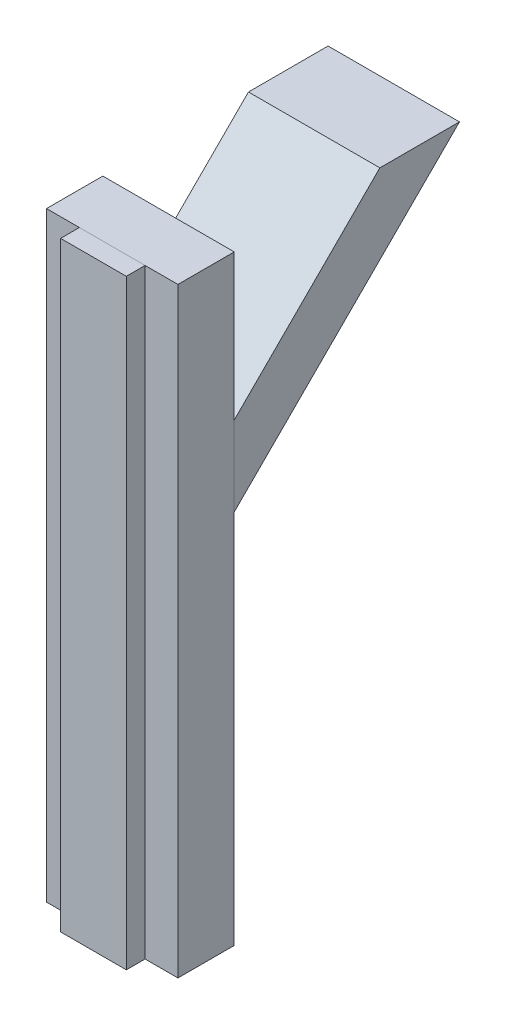
ISO-10303-21;
HEADER;
FILE_DESCRIPTION(('STEP AP214'),'2;1');
FILE_NAME('part.step','',(''),(''),'','','');
FILE_SCHEMA(('AUTOMOTIVE_DESIGN { 1 0 10303 214 1 1 1 1 }'));
ENDSEC;
DATA;
#1=APPLICATION_CONTEXT('core data for automotive mechanical design processes');
#2=APPLICATION_PROTOCOL_DEFINITION('international standard','automotive_design',2000,#1);
#3=PRODUCT_CONTEXT('',#1,'mechanical');
#4=PRODUCT('Part','Part','',(#3));
#5=PRODUCT_RELATED_PRODUCT_CATEGORY('part','',(#4));
#6=PRODUCT_DEFINITION_FORMATION('','',#4);
#7=PRODUCT_DEFINITION_CONTEXT('part definition',#1,'design');
#8=PRODUCT_DEFINITION('design','',#6,#7);
#9=PRODUCT_DEFINITION_SHAPE('','',#8);
#10=(LENGTH_UNIT() NAMED_UNIT(*) SI_UNIT(.MILLI.,.METRE.));
#11=(NAMED_UNIT(*) PLANE_ANGLE_UNIT() SI_UNIT($,.RADIAN.));
#12=(NAMED_UNIT(*) SI_UNIT($,.STERADIAN.) SOLID_ANGLE_UNIT());
#13=UNCERTAINTY_MEASURE_WITH_UNIT(LENGTH_MEASURE(1.E-05),#10,'distance_accuracy_value','');
#14=(GEOMETRIC_REPRESENTATION_CONTEXT(3) GLOBAL_UNCERTAINTY_ASSIGNED_CONTEXT((#13)) GLOBAL_UNIT_ASSIGNED_CONTEXT((#10,
#11,#12)) REPRESENTATION_CONTEXT('',''));
#15=CARTESIAN_POINT('',(0.,0.,0.));
#16=DIRECTION('',(0.,0.,1.));
#17=DIRECTION('',(1.,0.,0.));
#18=AXIS2_PLACEMENT_3D('',#15,#16,#17);
#19=CARTESIAN_POINT('',(66.675,0.,31.7499999999999));
#20=DIRECTION('',(-1.,0.,0.));
#21=DIRECTION('',(0.,0.,1.));
#22=AXIS2_PLACEMENT_3D('',#19,#20,#21);
#23=PLANE('',#22);
#24=DIRECTION('',(0.,1.,0.));
#25=VECTOR('',#24,1.);
#26=CARTESIAN_POINT('',(66.675,0.,19.0499999999999));
#27=LINE('',#26,#25);
#28=CARTESIAN_POINT('',(66.675,-406.4,19.0499999999999));
#29=VERTEX_POINT('',#28);
#30=CARTESIAN_POINT('',(66.675,0.,19.0499999999999));
#31=VERTEX_POINT('',#30);
#32=EDGE_CURVE('E107',#29,#31,#27,.T.);
#33=ORIENTED_EDGE('',*,*,#32,.T.);
#34=DIRECTION('',(0.,0.,-1.));
#35=VECTOR('',#34,1.);
#36=CARTESIAN_POINT('',(66.675,0.,31.7499999999999));
#37=LINE('',#36,#35);
#38=CARTESIAN_POINT('',(66.675,0.,31.7499999999999));
#39=VERTEX_POINT('',#38);
#40=EDGE_CURVE('E12',#39,#31,#37,.T.);
#41=ORIENTED_EDGE('',*,*,#40,.F.);
#42=DIRECTION('',(0.,1.,0.));
#43=VECTOR('',#42,1.);
#44=CARTESIAN_POINT('',(66.675,0.,31.7499999999999));
#45=LINE('',#44,#43);
#46=CARTESIAN_POINT('',(66.675,-406.4,31.7499999999999));
#47=VERTEX_POINT('',#46);
#48=EDGE_CURVE('E95',#47,#39,#45,.T.);
#49=ORIENTED_EDGE('',*,*,#48,.F.);
#50=DIRECTION('',(0.,0.,-1.));
#51=VECTOR('',#50,1.);
#52=CARTESIAN_POINT('',(66.675,-406.4,31.7499999999999));
#53=LINE('',#52,#51);
#54=EDGE_CURVE('E103',#47,#29,#53,.T.);
#55=ORIENTED_EDGE('',*,*,#54,.T.);
#56=EDGE_LOOP('',(#33,#41,#49,#55));
#57=FACE_BOUND('',#56,.T.);
#58=ADVANCED_FACE('F44',(#57),#23,.F.);
#59=CARTESIAN_POINT('',(66.675,0.,31.7499999999999));
#60=DIRECTION('',(0.,-1.,0.));
#61=DIRECTION('',(1.,0.,0.));
#62=AXIS2_PLACEMENT_3D('',#59,#60,#61);
#63=PLANE('',#62);
#64=DIRECTION('',(-1.,0.,0.));
#65=VECTOR('',#64,1.);
#66=CARTESIAN_POINT('',(66.675,0.,19.0499999999999));
#67=LINE('',#66,#65);
#68=CARTESIAN_POINT('',(22.225,0.,19.0499999999999));
#69=VERTEX_POINT('',#68);
#70=EDGE_CURVE('E99',#31,#69,#67,.T.);
#71=ORIENTED_EDGE('',*,*,#70,.T.);
#72=DIRECTION('',(0.,0.,-1.));
#73=VECTOR('',#72,1.);
#74=CARTESIAN_POINT('',(22.225,0.,31.7499999999999));
#75=LINE('',#74,#73);
#76=CARTESIAN_POINT('',(22.225,0.,31.7499999999999));
#77=VERTEX_POINT('',#76);
#78=EDGE_CURVE('E52',#77,#69,#75,.T.);
#79=ORIENTED_EDGE('',*,*,#78,.F.);
#80=DIRECTION('',(-1.,0.,0.));
#81=VECTOR('',#80,1.);
#82=CARTESIAN_POINT('',(66.675,0.,31.7499999999999));
#83=LINE('',#82,#81);
#84=EDGE_CURVE('E90',#39,#77,#83,.T.);
#85=ORIENTED_EDGE('',*,*,#84,.F.);
#86=ORIENTED_EDGE('',*,*,#40,.T.);
#87=EDGE_LOOP('',(#71,#79,#85,#86));
#88=FACE_BOUND('',#87,.T.);
#89=ADVANCED_FACE('F98',(#88),#63,.F.);
#90=CARTESIAN_POINT('',(22.225,0.,31.7499999999999));
#91=DIRECTION('',(1.,0.,0.));
#92=DIRECTION('',(0.,1.,0.));
#93=AXIS2_PLACEMENT_3D('',#90,#91,#92);
#94=PLANE('',#93);
#95=DIRECTION('',(0.,-1.,0.));
#96=VECTOR('',#95,1.);
#97=CARTESIAN_POINT('',(22.225,0.,19.0499999999999));
#98=LINE('',#97,#96);
#99=CARTESIAN_POINT('',(22.225,-406.4,19.0499999999999));
#100=VERTEX_POINT('',#99);
#101=EDGE_CURVE('E77',#69,#100,#98,.T.);
#102=ORIENTED_EDGE('',*,*,#101,.T.);
#103=DIRECTION('',(0.,0.,-1.));
#104=VECTOR('',#103,1.);
#105=CARTESIAN_POINT('',(22.225,-406.4,31.7499999999999));
#106=LINE('',#105,#104);
#107=CARTESIAN_POINT('',(22.225,-406.4,31.7499999999999));
#108=VERTEX_POINT('',#107);
#109=EDGE_CURVE('E100',#108,#100,#106,.T.);
#110=ORIENTED_EDGE('',*,*,#109,.F.);
#111=DIRECTION('',(0.,-1.,0.));
#112=VECTOR('',#111,1.);
#113=CARTESIAN_POINT('',(22.225,0.,31.7499999999999));
#114=LINE('',#113,#112);
#115=EDGE_CURVE('E93',#77,#108,#114,.T.);
#116=ORIENTED_EDGE('',*,*,#115,.F.);
#117=ORIENTED_EDGE('',*,*,#78,.T.);
#118=EDGE_LOOP('',(#102,#110,#116,#117));
#119=FACE_BOUND('',#118,.T.);
#120=ADVANCED_FACE('F101',(#119),#94,.F.);
#121=CARTESIAN_POINT('',(66.675,-406.4,31.7499999999999));
#122=DIRECTION('',(0.,1.,0.));
#123=DIRECTION('',(0.,0.,1.));
#124=AXIS2_PLACEMENT_3D('',#121,#122,#123);
#125=PLANE('',#124);
#126=DIRECTION('',(1.,0.,0.));
#127=VECTOR('',#126,1.);
#128=CARTESIAN_POINT('',(66.675,-406.4,19.0499999999999));
#129=LINE('',#128,#127);
#130=EDGE_CURVE('E83',#100,#29,#129,.T.);
#131=ORIENTED_EDGE('',*,*,#130,.T.);
#132=ORIENTED_EDGE('',*,*,#54,.F.);
#133=DIRECTION('',(1.,0.,0.));
#134=VECTOR('',#133,1.);
#135=CARTESIAN_POINT('',(66.675,-406.4,31.7499999999999));
#136=LINE('',#135,#134);
#137=EDGE_CURVE('E60',#108,#47,#136,.T.);
#138=ORIENTED_EDGE('',*,*,#137,.F.);
#139=ORIENTED_EDGE('',*,*,#109,.T.);
#140=EDGE_LOOP('',(#131,#132,#138,#139));
#141=FACE_BOUND('',#140,.T.);
#142=ADVANCED_FACE('F114',(#141),#125,.F.);
#143=CARTESIAN_POINT('',(0.,0.,31.7499999999999));
#144=DIRECTION('',(0.,0.,-1.));
#145=DIRECTION('',(-1.,0.,0.));
#146=AXIS2_PLACEMENT_3D('',#143,#144,#145);
#147=PLANE('',#146);
#148=ORIENTED_EDGE('',*,*,#48,.T.);
#149=ORIENTED_EDGE('',*,*,#84,.T.);
#150=ORIENTED_EDGE('',*,*,#115,.T.);
#151=ORIENTED_EDGE('',*,*,#137,.T.);
#152=EDGE_LOOP('',(#148,#149,#150,#151));
#153=FACE_BOUND('',#152,.T.);
#154=ADVANCED_FACE('F91',(#153),#147,.F.);
#155=CARTESIAN_POINT('',(0.,0.,19.0499999999999));
#156=DIRECTION('',(0.,0.,-1.));
#157=DIRECTION('',(-1.,0.,0.));
#158=AXIS2_PLACEMENT_3D('',#155,#156,#157);
#159=PLANE('',#158);
#160=ORIENTED_EDGE('',*,*,#32,.F.);
#161=ORIENTED_EDGE('',*,*,#130,.F.);
#162=ORIENTED_EDGE('',*,*,#101,.F.);
#163=ORIENTED_EDGE('',*,*,#70,.F.);
#164=EDGE_LOOP('',(#160,#161,#162,#163));
#165=FACE_BOUND('',#164,.T.);
#166=ADVANCED_FACE('F117',(#165),#159,.T.);
#167=CLOSED_SHELL('',(#58,#89,#120,#142,#154,#166));
#168=MANIFOLD_SOLID_BREP('B2',#167);
#169=CARTESIAN_POINT('',(88.9,-98.5184632735851,-19.05));
#170=DIRECTION('',(0.,0.,-1.));
#171=DIRECTION('',(0.,1.,0.));
#172=AXIS2_PLACEMENT_3D('',#169,#170,#171);
#173=PLANE('',#172);
#174=DIRECTION('',(0.,-1.,0.));
#175=VECTOR('',#174,1.);
#176=CARTESIAN_POINT('',(0.,-98.5184632735851,-19.05));
#177=LINE('',#176,#175);
#178=CARTESIAN_POINT('',(0.,-98.5184632735851,-19.05));
#179=VERTEX_POINT('',#178);
#180=CARTESIAN_POINT('',(0.,-152.4,-19.05));
#181=VERTEX_POINT('',#180);
#182=EDGE_CURVE('E240',#179,#181,#177,.T.);
#183=ORIENTED_EDGE('',*,*,#182,.T.);
#184=DIRECTION('',(-1.,0.,0.));
#185=VECTOR('',#184,1.);
#186=CARTESIAN_POINT('',(88.9,-152.4,-19.05));
#187=LINE('',#186,#185);
#188=CARTESIAN_POINT('',(88.9,-152.4,-19.05));
#189=VERTEX_POINT('',#188);
#190=EDGE_CURVE('E42',#189,#181,#187,.T.);
#191=ORIENTED_EDGE('',*,*,#190,.F.);
#192=DIRECTION('',(0.,-1.,0.));
#193=VECTOR('',#192,1.);
#194=CARTESIAN_POINT('',(88.9,-98.5184632735851,-19.05));
#195=LINE('',#194,#193);
#196=CARTESIAN_POINT('',(88.9,-98.5184632735851,-19.05));
#197=VERTEX_POINT('',#196);
#198=EDGE_CURVE('E228',#197,#189,#195,.T.);
#199=ORIENTED_EDGE('',*,*,#198,.F.);
#200=DIRECTION('',(-1.,0.,0.));
#201=VECTOR('',#200,1.);
#202=CARTESIAN_POINT('',(88.9,-98.5184632735851,-19.05));
#203=LINE('',#202,#201);
#204=EDGE_CURVE('E236',#197,#179,#203,.T.);
#205=ORIENTED_EDGE('',*,*,#204,.T.);
#206=EDGE_LOOP('',(#183,#191,#199,#205));
#207=FACE_BOUND('',#206,.T.);
#208=ADVANCED_FACE('F177',(#207),#173,.F.);
#209=CARTESIAN_POINT('',(88.9,-152.4,-19.05));
#210=DIRECTION('',(0.,0.707106781186548,0.707106781186547));
#211=DIRECTION('',(0.,-0.707106781186547,0.707106781186548));
#212=AXIS2_PLACEMENT_3D('',#209,#210,#211);
#213=PLANE('',#212);
#214=DIRECTION('',(0.,0.707106781186547,-0.707106781186548));
#215=VECTOR('',#214,1.);
#216=CARTESIAN_POINT('',(0.,-152.4,-19.05));
#217=LINE('',#216,#215);
#218=CARTESIAN_POINT('',(0.,0.,-171.45));
#219=VERTEX_POINT('',#218);
#220=EDGE_CURVE('E232',#181,#219,#217,.T.);
#221=ORIENTED_EDGE('',*,*,#220,.T.);
#222=DIRECTION('',(-1.,0.,0.));
#223=VECTOR('',#222,1.);
#224=CARTESIAN_POINT('',(88.9,0.,-171.45));
#225=LINE('',#224,#223);
#226=CARTESIAN_POINT('',(88.9,0.,-171.45));
#227=VERTEX_POINT('',#226);
#228=EDGE_CURVE('E185',#227,#219,#225,.T.);
#229=ORIENTED_EDGE('',*,*,#228,.F.);
#230=DIRECTION('',(0.,0.707106781186547,-0.707106781186548));
#231=VECTOR('',#230,1.);
#232=CARTESIAN_POINT('',(88.9,-152.4,-19.05));
#233=LINE('',#232,#231);
#234=EDGE_CURVE('E223',#189,#227,#233,.T.);
#235=ORIENTED_EDGE('',*,*,#234,.F.);
#236=ORIENTED_EDGE('',*,*,#190,.T.);
#237=EDGE_LOOP('',(#221,#229,#235,#236));
#238=FACE_BOUND('',#237,.T.);
#239=ADVANCED_FACE('F231',(#238),#213,.F.);
#240=CARTESIAN_POINT('',(88.9,0.,-117.568463273585));
#241=DIRECTION('',(0.,-1.,0.));
#242=DIRECTION('',(0.,0.,-1.));
#243=AXIS2_PLACEMENT_3D('',#240,#241,#242);
#244=PLANE('',#243);
#245=DIRECTION('',(0.,0.,1.));
#246=VECTOR('',#245,1.);
#247=CARTESIAN_POINT('',(0.,0.,-117.568463273585));
#248=LINE('',#247,#246);
#249=CARTESIAN_POINT('',(0.,0.,-117.568463273585));
#250=VERTEX_POINT('',#249);
#251=EDGE_CURVE('E210',#219,#250,#248,.T.);
#252=ORIENTED_EDGE('',*,*,#251,.T.);
#253=DIRECTION('',(-1.,0.,0.));
#254=VECTOR('',#253,1.);
#255=CARTESIAN_POINT('',(88.9,0.,-117.568463273585));
#256=LINE('',#255,#254);
#257=CARTESIAN_POINT('',(88.9,0.,-117.568463273585));
#258=VERTEX_POINT('',#257);
#259=EDGE_CURVE('E233',#258,#250,#256,.T.);
#260=ORIENTED_EDGE('',*,*,#259,.F.);
#261=DIRECTION('',(0.,0.,1.));
#262=VECTOR('',#261,1.);
#263=CARTESIAN_POINT('',(88.9,0.,-117.568463273585));
#264=LINE('',#263,#262);
#265=EDGE_CURVE('E226',#227,#258,#264,.T.);
#266=ORIENTED_EDGE('',*,*,#265,.F.);
#267=ORIENTED_EDGE('',*,*,#228,.T.);
#268=EDGE_LOOP('',(#252,#260,#266,#267));
#269=FACE_BOUND('',#268,.T.);
#270=ADVANCED_FACE('F234',(#269),#244,.F.);
#271=CARTESIAN_POINT('',(88.9,-98.5184632735851,-19.05));
#272=DIRECTION('',(0.,-0.707106781186547,-0.707106781186548));
#273=DIRECTION('',(0.,0.707106781186548,-0.707106781186547));
#274=AXIS2_PLACEMENT_3D('',#271,#272,#273);
#275=PLANE('',#274);
#276=DIRECTION('',(0.,-0.707106781186548,0.707106781186547));
#277=VECTOR('',#276,1.);
#278=CARTESIAN_POINT('',(0.,-98.5184632735851,-19.05));
#279=LINE('',#278,#277);
#280=EDGE_CURVE('E216',#250,#179,#279,.T.);
#281=ORIENTED_EDGE('',*,*,#280,.T.);
#282=ORIENTED_EDGE('',*,*,#204,.F.);
#283=DIRECTION('',(0.,-0.707106781186548,0.707106781186547));
#284=VECTOR('',#283,1.);
#285=CARTESIAN_POINT('',(88.9,-98.5184632735851,-19.05));
#286=LINE('',#285,#284);
#287=EDGE_CURVE('E193',#258,#197,#286,.T.);
#288=ORIENTED_EDGE('',*,*,#287,.F.);
#289=ORIENTED_EDGE('',*,*,#259,.T.);
#290=EDGE_LOOP('',(#281,#282,#288,#289));
#291=FACE_BOUND('',#290,.T.);
#292=ADVANCED_FACE('F247',(#291),#275,.F.);
#293=CARTESIAN_POINT('',(88.9,0.,0.));
#294=DIRECTION('',(1.,0.,0.));
#295=DIRECTION('',(0.,0.,-1.));
#296=AXIS2_PLACEMENT_3D('',#293,#294,#295);
#297=PLANE('',#296);
#298=ORIENTED_EDGE('',*,*,#198,.T.);
#299=ORIENTED_EDGE('',*,*,#234,.T.);
#300=ORIENTED_EDGE('',*,*,#265,.T.);
#301=ORIENTED_EDGE('',*,*,#287,.T.);
#302=EDGE_LOOP('',(#298,#299,#300,#301));
#303=FACE_BOUND('',#302,.T.);
#304=ADVANCED_FACE('F224',(#303),#297,.T.);
#305=CARTESIAN_POINT('',(0.,0.,0.));
#306=DIRECTION('',(1.,0.,0.));
#307=DIRECTION('',(0.,0.,-1.));
#308=AXIS2_PLACEMENT_3D('',#305,#306,#307);
#309=PLANE('',#308);
#310=ORIENTED_EDGE('',*,*,#182,.F.);
#311=ORIENTED_EDGE('',*,*,#280,.F.);
#312=ORIENTED_EDGE('',*,*,#251,.F.);
#313=ORIENTED_EDGE('',*,*,#220,.F.);
#314=EDGE_LOOP('',(#310,#311,#312,#313));
#315=FACE_BOUND('',#314,.T.);
#316=ADVANCED_FACE('F250',(#315),#309,.F.);
#317=CLOSED_SHELL('',(#208,#239,#270,#292,#304,#316));
#318=MANIFOLD_SOLID_BREP('B6',#317);
#319=CARTESIAN_POINT('',(88.9,0.,19.0499999999999));
#320=DIRECTION('',(0.,0.,-1.));
#321=DIRECTION('',(0.,1.,0.));
#322=AXIS2_PLACEMENT_3D('',#319,#320,#321);
#323=PLANE('',#322);
#324=DIRECTION('',(0.,-1.,0.));
#325=VECTOR('',#324,1.);
#326=CARTESIAN_POINT('',(0.,0.,19.0499999999999));
#327=LINE('',#326,#325);
#328=CARTESIAN_POINT('',(0.,0.,19.0499999999999));
#329=VERTEX_POINT('',#328);
#330=CARTESIAN_POINT('',(0.,-406.4,19.05));
#331=VERTEX_POINT('',#330);
#332=EDGE_CURVE('E364',#329,#331,#327,.T.);
#333=ORIENTED_EDGE('',*,*,#332,.T.);
#334=DIRECTION('',(-1.,0.,0.));
#335=VECTOR('',#334,1.);
#336=CARTESIAN_POINT('',(88.9,-406.4,19.05));
#337=LINE('',#336,#335);
#338=CARTESIAN_POINT('',(88.9,-406.4,19.05));
#339=VERTEX_POINT('',#338);
#340=EDGE_CURVE('E175',#339,#331,#337,.T.);
#341=ORIENTED_EDGE('',*,*,#340,.F.);
#342=DIRECTION('',(0.,-1.,0.));
#343=VECTOR('',#342,1.);
#344=CARTESIAN_POINT('',(88.9,0.,19.0499999999999));
#345=LINE('',#344,#343);
#346=CARTESIAN_POINT('',(88.9,0.,19.0499999999999));
#347=VERTEX_POINT('',#346);
#348=EDGE_CURVE('E352',#347,#339,#345,.T.);
#349=ORIENTED_EDGE('',*,*,#348,.F.);
#350=DIRECTION('',(-1.,0.,0.));
#351=VECTOR('',#350,1.);
#352=CARTESIAN_POINT('',(88.9,0.,19.0499999999999));
#353=LINE('',#352,#351);
#354=EDGE_CURVE('E360',#347,#329,#353,.T.);
#355=ORIENTED_EDGE('',*,*,#354,.T.);
#356=EDGE_LOOP('',(#333,#341,#349,#355));
#357=FACE_BOUND('',#356,.T.);
#358=ADVANCED_FACE('F301',(#357),#323,.F.);
#359=CARTESIAN_POINT('',(88.9,-406.4,19.05));
#360=DIRECTION('',(0.,1.,0.));
#361=DIRECTION('',(0.,0.,1.));
#362=AXIS2_PLACEMENT_3D('',#359,#360,#361);
#363=PLANE('',#362);
#364=DIRECTION('',(0.,0.,-1.));
#365=VECTOR('',#364,1.);
#366=CARTESIAN_POINT('',(0.,-406.4,19.05));
#367=LINE('',#366,#365);
#368=CARTESIAN_POINT('',(0.,-406.4,-19.05));
#369=VERTEX_POINT('',#368);
#370=EDGE_CURVE('E356',#331,#369,#367,.T.);
#371=ORIENTED_EDGE('',*,*,#370,.T.);
#372=DIRECTION('',(-1.,0.,0.));
#373=VECTOR('',#372,1.);
#374=CARTESIAN_POINT('',(88.9,-406.4,-19.05));
#375=LINE('',#374,#373);
#376=CARTESIAN_POINT('',(88.9,-406.4,-19.05));
#377=VERTEX_POINT('',#376);
#378=EDGE_CURVE('E309',#377,#369,#375,.T.);
#379=ORIENTED_EDGE('',*,*,#378,.F.);
#380=DIRECTION('',(0.,0.,-1.));
#381=VECTOR('',#380,1.);
#382=CARTESIAN_POINT('',(88.9,-406.4,19.05));
#383=LINE('',#382,#381);
#384=EDGE_CURVE('E347',#339,#377,#383,.T.);
#385=ORIENTED_EDGE('',*,*,#384,.F.);
#386=ORIENTED_EDGE('',*,*,#340,.T.);
#387=EDGE_LOOP('',(#371,#379,#385,#386));
#388=FACE_BOUND('',#387,.T.);
#389=ADVANCED_FACE('F355',(#388),#363,.F.);
#390=CARTESIAN_POINT('',(88.9,0.,-19.0499999999999));
#391=DIRECTION('',(0.,0.,1.));
#392=DIRECTION('',(0.,-1.,0.));
#393=AXIS2_PLACEMENT_3D('',#390,#391,#392);
#394=PLANE('',#393);
#395=DIRECTION('',(0.,1.,0.));
#396=VECTOR('',#395,1.);
#397=CARTESIAN_POINT('',(0.,0.,-19.0499999999999));
#398=LINE('',#397,#396);
#399=CARTESIAN_POINT('',(0.,0.,-19.0499999999999));
#400=VERTEX_POINT('',#399);
#401=EDGE_CURVE('E334',#369,#400,#398,.T.);
#402=ORIENTED_EDGE('',*,*,#401,.T.);
#403=DIRECTION('',(-1.,0.,0.));
#404=VECTOR('',#403,1.);
#405=CARTESIAN_POINT('',(88.9,0.,-19.0499999999999));
#406=LINE('',#405,#404);
#407=CARTESIAN_POINT('',(88.9,0.,-19.0499999999999));
#408=VERTEX_POINT('',#407);
#409=EDGE_CURVE('E357',#408,#400,#406,.T.);
#410=ORIENTED_EDGE('',*,*,#409,.F.);
#411=DIRECTION('',(0.,1.,0.));
#412=VECTOR('',#411,1.);
#413=CARTESIAN_POINT('',(88.9,0.,-19.0499999999999));
#414=LINE('',#413,#412);
#415=EDGE_CURVE('E350',#377,#408,#414,.T.);
#416=ORIENTED_EDGE('',*,*,#415,.F.);
#417=ORIENTED_EDGE('',*,*,#378,.T.);
#418=EDGE_LOOP('',(#402,#410,#416,#417));
#419=FACE_BOUND('',#418,.T.);
#420=ADVANCED_FACE('F358',(#419),#394,.F.);
#421=CARTESIAN_POINT('',(88.9,0.,19.0499999999999));
#422=DIRECTION('',(0.,-1.,0.));
#423=DIRECTION('',(0.,0.,-1.));
#424=AXIS2_PLACEMENT_3D('',#421,#422,#423);
#425=PLANE('',#424);
#426=DIRECTION('',(0.,0.,1.));
#427=VECTOR('',#426,1.);
#428=CARTESIAN_POINT('',(0.,0.,19.0499999999999));
#429=LINE('',#428,#427);
#430=EDGE_CURVE('E340',#400,#329,#429,.T.);
#431=ORIENTED_EDGE('',*,*,#430,.T.);
#432=ORIENTED_EDGE('',*,*,#354,.F.);
#433=DIRECTION('',(0.,0.,1.));
#434=VECTOR('',#433,1.);
#435=CARTESIAN_POINT('',(88.9,0.,19.0499999999999));
#436=LINE('',#435,#434);
#437=EDGE_CURVE('E317',#408,#347,#436,.T.);
#438=ORIENTED_EDGE('',*,*,#437,.F.);
#439=ORIENTED_EDGE('',*,*,#409,.T.);
#440=EDGE_LOOP('',(#431,#432,#438,#439));
#441=FACE_BOUND('',#440,.T.);
#442=ADVANCED_FACE('F371',(#441),#425,.F.);
#443=CARTESIAN_POINT('',(88.9,0.,0.));
#444=DIRECTION('',(1.,0.,0.));
#445=DIRECTION('',(0.,0.,-1.));
#446=AXIS2_PLACEMENT_3D('',#443,#444,#445);
#447=PLANE('',#446);
#448=ORIENTED_EDGE('',*,*,#348,.T.);
#449=ORIENTED_EDGE('',*,*,#384,.T.);
#450=ORIENTED_EDGE('',*,*,#415,.T.);
#451=ORIENTED_EDGE('',*,*,#437,.T.);
#452=EDGE_LOOP('',(#448,#449,#450,#451));
#453=FACE_BOUND('',#452,.T.);
#454=ADVANCED_FACE('F348',(#453),#447,.T.);
#455=CARTESIAN_POINT('',(0.,0.,0.));
#456=DIRECTION('',(1.,0.,0.));
#457=DIRECTION('',(0.,0.,-1.));
#458=AXIS2_PLACEMENT_3D('',#455,#456,#457);
#459=PLANE('',#458);
#460=ORIENTED_EDGE('',*,*,#332,.F.);
#461=ORIENTED_EDGE('',*,*,#430,.F.);
#462=ORIENTED_EDGE('',*,*,#401,.F.);
#463=ORIENTED_EDGE('',*,*,#370,.F.);
#464=EDGE_LOOP('',(#460,#461,#462,#463));
#465=FACE_BOUND('',#464,.T.);
#466=ADVANCED_FACE('F374',(#465),#459,.F.);
#467=CLOSED_SHELL('',(#358,#389,#420,#442,#454,#466));
#468=MANIFOLD_SOLID_BREP('B36',#467);
#469=ADVANCED_BREP_SHAPE_REPRESENTATION('',(#18,#168,#318,#468),#14);
#470=SHAPE_DEFINITION_REPRESENTATION(#9,#469);
ENDSEC;
END-ISO-10303-21;
